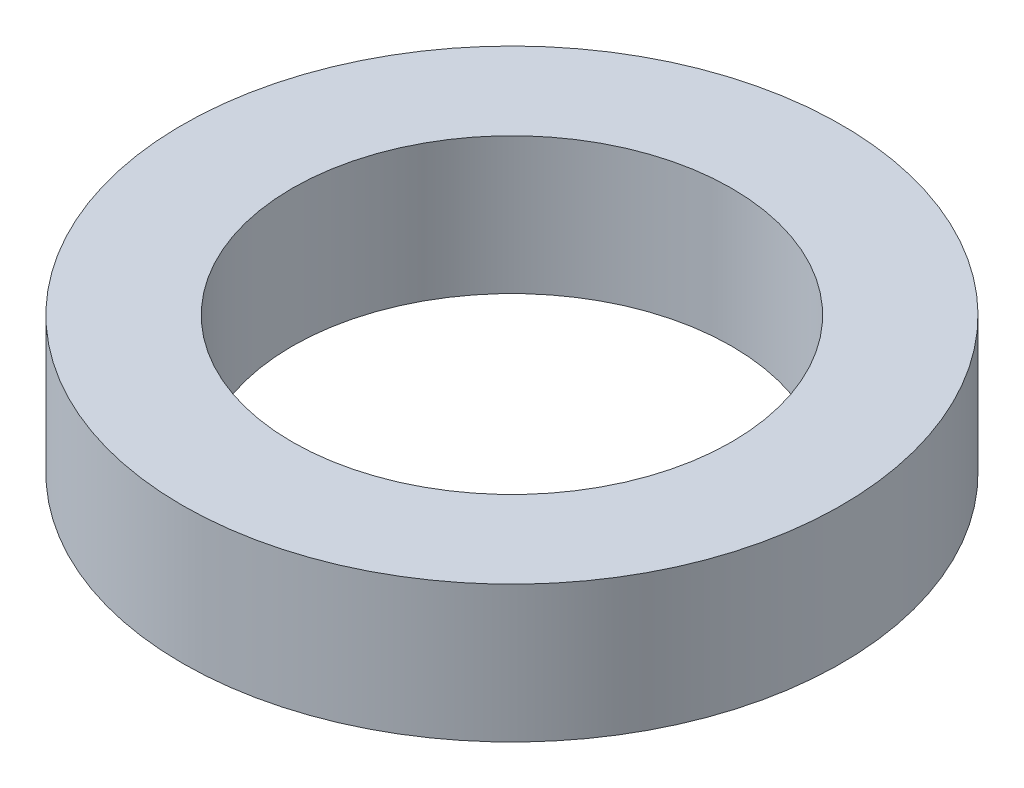
ISO-10303-21;
HEADER;
FILE_DESCRIPTION(('STEP AP214'),'2;1');
FILE_NAME('part.step','',(''),(''),'','','');
FILE_SCHEMA(('AUTOMOTIVE_DESIGN { 1 0 10303 214 1 1 1 1 }'));
ENDSEC;
DATA;
#1=APPLICATION_CONTEXT('core data for automotive mechanical design processes');
#2=APPLICATION_PROTOCOL_DEFINITION('international standard','automotive_design',2000,#1);
#3=PRODUCT_CONTEXT('',#1,'mechanical');
#4=PRODUCT('Part','Part','',(#3));
#5=PRODUCT_RELATED_PRODUCT_CATEGORY('part','',(#4));
#6=PRODUCT_DEFINITION_FORMATION('','',#4);
#7=PRODUCT_DEFINITION_CONTEXT('part definition',#1,'design');
#8=PRODUCT_DEFINITION('design','',#6,#7);
#9=PRODUCT_DEFINITION_SHAPE('','',#8);
#10=(LENGTH_UNIT() NAMED_UNIT(*) SI_UNIT(.MILLI.,.METRE.));
#11=(NAMED_UNIT(*) PLANE_ANGLE_UNIT() SI_UNIT($,.RADIAN.));
#12=(NAMED_UNIT(*) SI_UNIT($,.STERADIAN.) SOLID_ANGLE_UNIT());
#13=UNCERTAINTY_MEASURE_WITH_UNIT(LENGTH_MEASURE(1.E-05),#10,'distance_accuracy_value','');
#14=(GEOMETRIC_REPRESENTATION_CONTEXT(3) GLOBAL_UNCERTAINTY_ASSIGNED_CONTEXT((#13)) GLOBAL_UNIT_ASSIGNED_CONTEXT((#10,
#11,#12)) REPRESENTATION_CONTEXT('',''));
#15=CARTESIAN_POINT('',(0.,0.,0.));
#16=DIRECTION('',(0.,0.,1.));
#17=DIRECTION('',(1.,0.,0.));
#18=AXIS2_PLACEMENT_3D('',#15,#16,#17);
#19=CARTESIAN_POINT('',(0.,28.,0.));
#20=DIRECTION('',(0.,-1.,0.));
#21=DIRECTION('',(0.,0.,-1.));
#22=AXIS2_PLACEMENT_3D('',#19,#20,#21);
#23=CYLINDRICAL_SURFACE('',#22,67.5);
#24=CARTESIAN_POINT('',(0.,28.,0.));
#25=DIRECTION('',(0.,1.,0.));
#26=DIRECTION('',(0.,0.,1.));
#27=AXIS2_PLACEMENT_3D('',#24,#25,#26);
#28=CIRCLE('',#27,67.5);
#29=CARTESIAN_POINT('',(0.,28.,67.5));
#30=VERTEX_POINT('',#29);
#31=EDGE_CURVE('E10',#30,#30,#28,.T.);
#32=ORIENTED_EDGE('',*,*,#31,.F.);
#33=EDGE_LOOP('',(#32));
#34=FACE_BOUND('',#33,.T.);
#35=CARTESIAN_POINT('',(0.,0.,0.));
#36=DIRECTION('',(0.,1.,0.));
#37=DIRECTION('',(0.,0.,1.));
#38=AXIS2_PLACEMENT_3D('',#35,#36,#37);
#39=CIRCLE('',#38,67.5);
#40=CARTESIAN_POINT('',(0.,0.,67.5));
#41=VERTEX_POINT('',#40);
#42=EDGE_CURVE('E37',#41,#41,#39,.T.);
#43=ORIENTED_EDGE('',*,*,#42,.T.);
#44=EDGE_LOOP('',(#43));
#45=FACE_BOUND('',#44,.T.);
#46=ADVANCED_FACE('F40',(#34,#45),#23,.T.);
#47=CARTESIAN_POINT('',(0.,28.,0.));
#48=DIRECTION('',(0.,1.,0.));
#49=DIRECTION('',(0.,0.,1.));
#50=AXIS2_PLACEMENT_3D('',#47,#48,#49);
#51=PLANE('',#50);
#52=CARTESIAN_POINT('',(0.,28.,0.));
#53=DIRECTION('',(0.,1.,0.));
#54=DIRECTION('',(0.,0.,1.));
#55=AXIS2_PLACEMENT_3D('',#52,#53,#54);
#56=CIRCLE('',#55,45.);
#57=CARTESIAN_POINT('',(0.,28.,45.));
#58=VERTEX_POINT('',#57);
#59=EDGE_CURVE('E50',#58,#58,#56,.T.);
#60=ORIENTED_EDGE('',*,*,#59,.F.);
#61=EDGE_LOOP('',(#60));
#62=FACE_BOUND('',#61,.T.);
#63=ORIENTED_EDGE('',*,*,#31,.T.);
#64=EDGE_LOOP('',(#63));
#65=FACE_BOUND('',#64,.T.);
#66=ADVANCED_FACE('F59',(#62,#65),#51,.T.);
#67=CARTESIAN_POINT('',(0.,0.,0.));
#68=DIRECTION('',(0.,1.,0.));
#69=DIRECTION('',(0.,0.,1.));
#70=AXIS2_PLACEMENT_3D('',#67,#68,#69);
#71=PLANE('',#70);
#72=CARTESIAN_POINT('',(0.,0.,0.));
#73=DIRECTION('',(0.,1.,0.));
#74=DIRECTION('',(0.,0.,1.));
#75=AXIS2_PLACEMENT_3D('',#72,#73,#74);
#76=CIRCLE('',#75,45.);
#77=CARTESIAN_POINT('',(0.,0.,45.));
#78=VERTEX_POINT('',#77);
#79=EDGE_CURVE('E47',#78,#78,#76,.T.);
#80=ORIENTED_EDGE('',*,*,#79,.T.);
#81=EDGE_LOOP('',(#80));
#82=FACE_BOUND('',#81,.T.);
#83=ORIENTED_EDGE('',*,*,#42,.F.);
#84=EDGE_LOOP('',(#83));
#85=FACE_BOUND('',#84,.T.);
#86=ADVANCED_FACE('F58',(#82,#85),#71,.F.);
#87=CARTESIAN_POINT('',(0.,28.,0.));
#88=DIRECTION('',(0.,-1.,0.));
#89=DIRECTION('',(0.,0.,-1.));
#90=AXIS2_PLACEMENT_3D('',#87,#88,#89);
#91=CYLINDRICAL_SURFACE('',#90,45.);
#92=ORIENTED_EDGE('',*,*,#59,.T.);
#93=EDGE_LOOP('',(#92));
#94=FACE_BOUND('',#93,.T.);
#95=ORIENTED_EDGE('',*,*,#79,.F.);
#96=EDGE_LOOP('',(#95));
#97=FACE_BOUND('',#96,.T.);
#98=ADVANCED_FACE('F54',(#94,#97),#91,.F.);
#99=CLOSED_SHELL('',(#46,#66,#86,#98));
#100=MANIFOLD_SOLID_BREP('B2',#99);
#101=ADVANCED_BREP_SHAPE_REPRESENTATION('',(#18,#100),#14);
#102=SHAPE_DEFINITION_REPRESENTATION(#9,#101);
ENDSEC;
END-ISO-10303-21;
